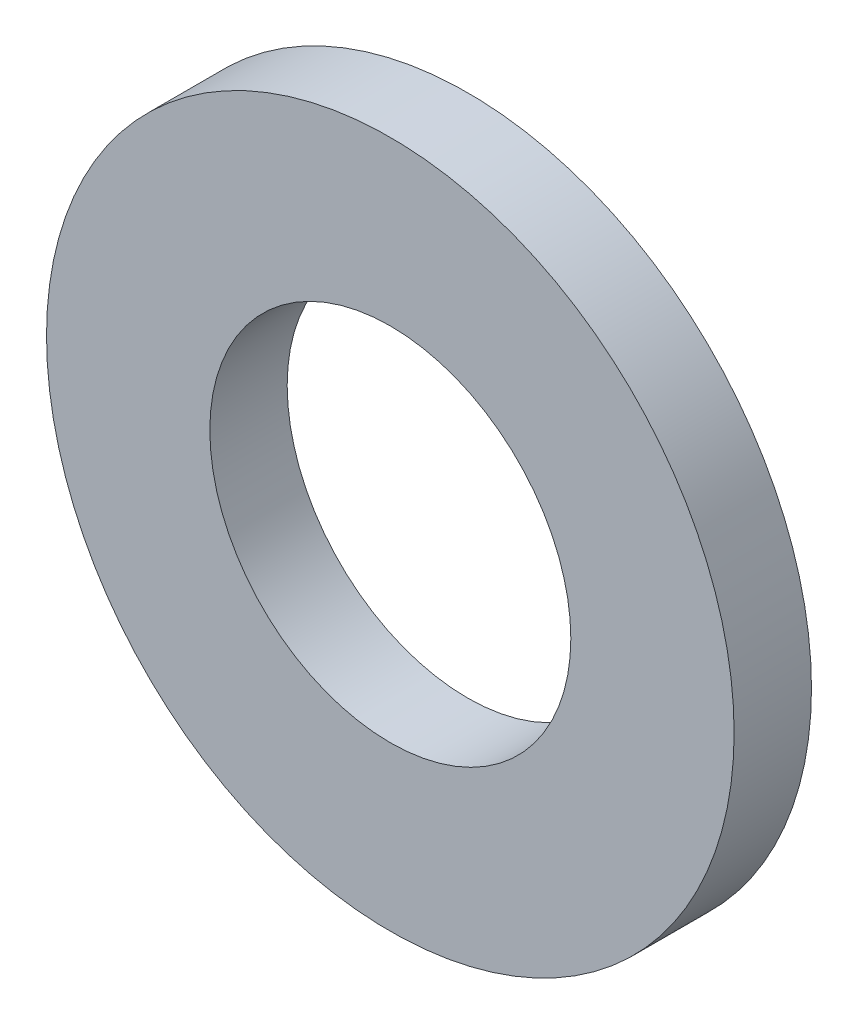
ISO-10303-21;
HEADER;
FILE_DESCRIPTION(('STEP AP214'),'2;1');
FILE_NAME('part.step','',(''),(''),'','','');
FILE_SCHEMA(('AUTOMOTIVE_DESIGN { 1 0 10303 214 1 1 1 1 }'));
ENDSEC;
DATA;
#1=APPLICATION_CONTEXT('core data for automotive mechanical design processes');
#2=APPLICATION_PROTOCOL_DEFINITION('international standard','automotive_design',2000,#1);
#3=PRODUCT_CONTEXT('',#1,'mechanical');
#4=PRODUCT('Part','Part','',(#3));
#5=PRODUCT_RELATED_PRODUCT_CATEGORY('part','',(#4));
#6=PRODUCT_DEFINITION_FORMATION('','',#4);
#7=PRODUCT_DEFINITION_CONTEXT('part definition',#1,'design');
#8=PRODUCT_DEFINITION('design','',#6,#7);
#9=PRODUCT_DEFINITION_SHAPE('','',#8);
#10=(LENGTH_UNIT() NAMED_UNIT(*) SI_UNIT(.MILLI.,.METRE.));
#11=(NAMED_UNIT(*) PLANE_ANGLE_UNIT() SI_UNIT($,.RADIAN.));
#12=(NAMED_UNIT(*) SI_UNIT($,.STERADIAN.) SOLID_ANGLE_UNIT());
#13=UNCERTAINTY_MEASURE_WITH_UNIT(LENGTH_MEASURE(1.E-05),#10,'distance_accuracy_value','');
#14=(GEOMETRIC_REPRESENTATION_CONTEXT(3) GLOBAL_UNCERTAINTY_ASSIGNED_CONTEXT((#13)) GLOBAL_UNIT_ASSIGNED_CONTEXT((#10,
#11,#12)) REPRESENTATION_CONTEXT('',''));
#15=CARTESIAN_POINT('',(0.,0.,0.));
#16=DIRECTION('',(0.,0.,1.));
#17=DIRECTION('',(1.,0.,0.));
#18=AXIS2_PLACEMENT_3D('',#15,#16,#17);
#19=CARTESIAN_POINT('',(0.,0.,1.8));
#20=DIRECTION('',(0.,0.,1.));
#21=DIRECTION('',(1.,0.,0.));
#22=AXIS2_PLACEMENT_3D('',#19,#20,#21);
#23=PLANE('',#22);
#24=CARTESIAN_POINT('',(0.,0.,1.8));
#25=DIRECTION('',(0.,0.,1.));
#26=DIRECTION('',(1.,0.,0.));
#27=AXIS2_PLACEMENT_3D('',#24,#25,#26);
#28=CIRCLE('',#27,8.);
#29=CARTESIAN_POINT('',(8.,0.,1.8));
#30=VERTEX_POINT('',#29);
#31=EDGE_CURVE('E10',#30,#30,#28,.T.);
#32=ORIENTED_EDGE('',*,*,#31,.T.);
#33=EDGE_LOOP('',(#32));
#34=FACE_BOUND('',#33,.T.);
#35=CARTESIAN_POINT('',(0.,0.,1.8));
#36=DIRECTION('',(0.,0.,1.));
#37=DIRECTION('',(1.,0.,0.));
#38=AXIS2_PLACEMENT_3D('',#35,#36,#37);
#39=CIRCLE('',#38,4.2);
#40=CARTESIAN_POINT('',(4.2,0.,1.8));
#41=VERTEX_POINT('',#40);
#42=EDGE_CURVE('E41',#41,#41,#39,.T.);
#43=ORIENTED_EDGE('',*,*,#42,.F.);
#44=EDGE_LOOP('',(#43));
#45=FACE_BOUND('',#44,.T.);
#46=ADVANCED_FACE('F30',(#34,#45),#23,.T.);
#47=CARTESIAN_POINT('',(0.,0.,0.));
#48=DIRECTION('',(0.,0.,1.));
#49=DIRECTION('',(1.,0.,0.));
#50=AXIS2_PLACEMENT_3D('',#47,#48,#49);
#51=PLANE('',#50);
#52=CARTESIAN_POINT('',(0.,0.,0.));
#53=DIRECTION('',(0.,0.,1.));
#54=DIRECTION('',(1.,0.,0.));
#55=AXIS2_PLACEMENT_3D('',#52,#53,#54);
#56=CIRCLE('',#55,8.);
#57=CARTESIAN_POINT('',(8.,0.,0.));
#58=VERTEX_POINT('',#57);
#59=EDGE_CURVE('E34',#58,#58,#56,.T.);
#60=ORIENTED_EDGE('',*,*,#59,.F.);
#61=EDGE_LOOP('',(#60));
#62=FACE_BOUND('',#61,.T.);
#63=CARTESIAN_POINT('',(0.,0.,0.));
#64=DIRECTION('',(0.,0.,1.));
#65=DIRECTION('',(1.,0.,0.));
#66=AXIS2_PLACEMENT_3D('',#63,#64,#65);
#67=CIRCLE('',#66,4.2);
#68=CARTESIAN_POINT('',(4.2,0.,0.));
#69=VERTEX_POINT('',#68);
#70=EDGE_CURVE('E43',#69,#69,#67,.T.);
#71=ORIENTED_EDGE('',*,*,#70,.T.);
#72=EDGE_LOOP('',(#71));
#73=FACE_BOUND('',#72,.T.);
#74=ADVANCED_FACE('F53',(#62,#73),#51,.F.);
#75=CARTESIAN_POINT('',(0.,0.,1.8));
#76=DIRECTION('',(0.,0.,-1.));
#77=DIRECTION('',(-1.,0.,0.));
#78=AXIS2_PLACEMENT_3D('',#75,#76,#77);
#79=CYLINDRICAL_SURFACE('',#78,8.);
#80=ORIENTED_EDGE('',*,*,#31,.F.);
#81=EDGE_LOOP('',(#80));
#82=FACE_BOUND('',#81,.T.);
#83=ORIENTED_EDGE('',*,*,#59,.T.);
#84=EDGE_LOOP('',(#83));
#85=FACE_BOUND('',#84,.T.);
#86=ADVANCED_FACE('F32',(#82,#85),#79,.T.);
#87=CARTESIAN_POINT('',(0.,0.,1.8));
#88=DIRECTION('',(0.,0.,-1.));
#89=DIRECTION('',(-1.,0.,0.));
#90=AXIS2_PLACEMENT_3D('',#87,#88,#89);
#91=CYLINDRICAL_SURFACE('',#90,4.2);
#92=ORIENTED_EDGE('',*,*,#42,.T.);
#93=EDGE_LOOP('',(#92));
#94=FACE_BOUND('',#93,.T.);
#95=ORIENTED_EDGE('',*,*,#70,.F.);
#96=EDGE_LOOP('',(#95));
#97=FACE_BOUND('',#96,.T.);
#98=ADVANCED_FACE('F49',(#94,#97),#91,.F.);
#99=CLOSED_SHELL('',(#46,#74,#86,#98));
#100=MANIFOLD_SOLID_BREP('B2',#99);
#101=ADVANCED_BREP_SHAPE_REPRESENTATION('',(#18,#100),#14);
#102=SHAPE_DEFINITION_REPRESENTATION(#9,#101);
ENDSEC;
END-ISO-10303-21;
